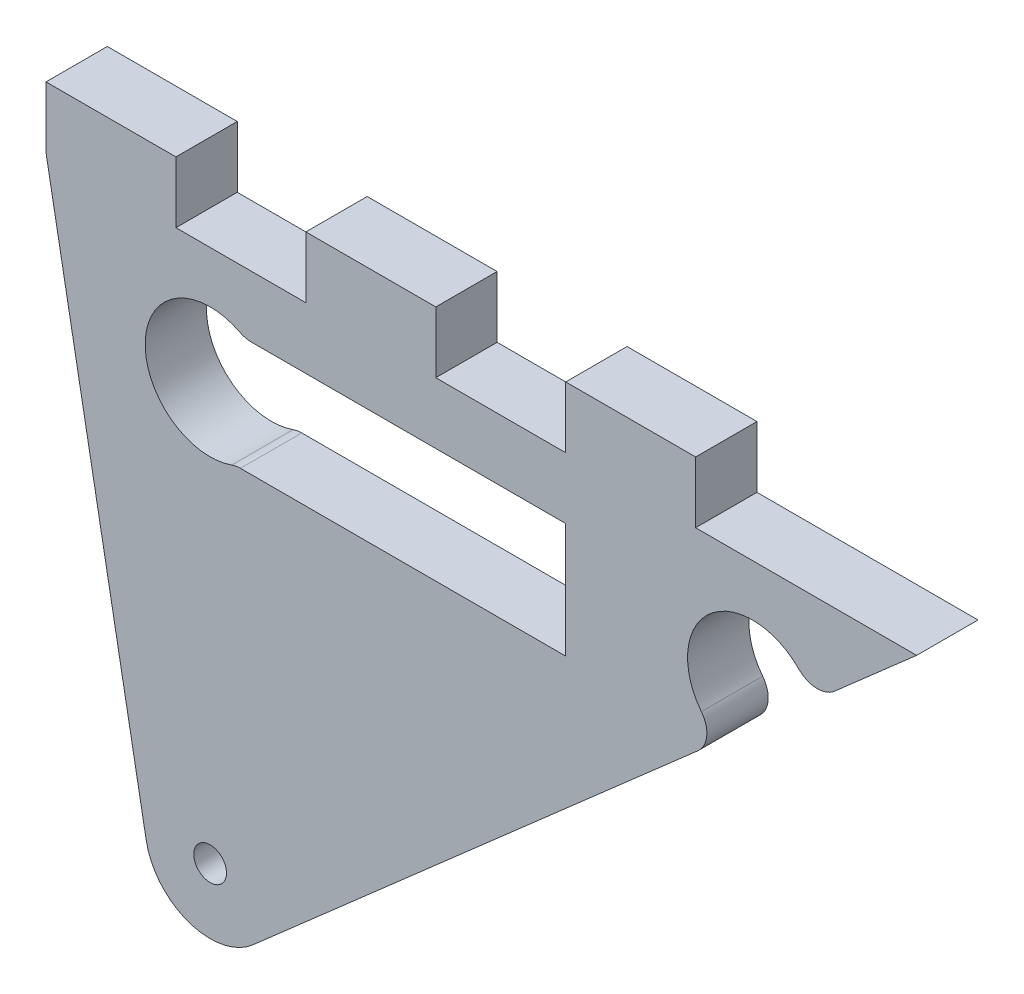
ISO-10303-21;
HEADER;
FILE_DESCRIPTION(('STEP AP214'),'2;1');
FILE_NAME('part.step','',(''),(''),'','','');
FILE_SCHEMA(('AUTOMOTIVE_DESIGN { 1 0 10303 214 1 1 1 1 }'));
ENDSEC;
DATA;
#1=APPLICATION_CONTEXT('core data for automotive mechanical design processes');
#2=APPLICATION_PROTOCOL_DEFINITION('international standard','automotive_design',2000,#1);
#3=PRODUCT_CONTEXT('',#1,'mechanical');
#4=PRODUCT('Part','Part','',(#3));
#5=PRODUCT_RELATED_PRODUCT_CATEGORY('part','',(#4));
#6=PRODUCT_DEFINITION_FORMATION('','',#4);
#7=PRODUCT_DEFINITION_CONTEXT('part definition',#1,'design');
#8=PRODUCT_DEFINITION('design','',#6,#7);
#9=PRODUCT_DEFINITION_SHAPE('','',#8);
#10=(LENGTH_UNIT() NAMED_UNIT(*) SI_UNIT(.MILLI.,.METRE.));
#11=(NAMED_UNIT(*) PLANE_ANGLE_UNIT() SI_UNIT($,.RADIAN.));
#12=(NAMED_UNIT(*) SI_UNIT($,.STERADIAN.) SOLID_ANGLE_UNIT());
#13=UNCERTAINTY_MEASURE_WITH_UNIT(LENGTH_MEASURE(1.E-05),#10,'distance_accuracy_value','');
#14=(GEOMETRIC_REPRESENTATION_CONTEXT(3) GLOBAL_UNCERTAINTY_ASSIGNED_CONTEXT((#13)) GLOBAL_UNIT_ASSIGNED_CONTEXT((#10,
#11,#12)) REPRESENTATION_CONTEXT('',''));
#15=CARTESIAN_POINT('',(0.,0.,0.));
#16=DIRECTION('',(0.,0.,1.));
#17=DIRECTION('',(1.,0.,0.));
#18=AXIS2_PLACEMENT_3D('',#15,#16,#17);
#19=CARTESIAN_POINT('',(1.19165429725396E-11,61.2277195457864,5.9944));
#20=DIRECTION('',(-1.94626601495886E-13,-1.,0.));
#21=DIRECTION('',(1.,-1.94626601495886E-13,0.));
#22=AXIS2_PLACEMENT_3D('',#19,#20,#21);
#23=PLANE('',#22);
#24=DIRECTION('',(-1.,1.94626601495886E-13,0.));
#25=VECTOR('',#24,1.);
#26=CARTESIAN_POINT('',(1.19165429725396E-11,61.2277195457864,0.));
#27=LINE('',#26,#25);
#28=CARTESIAN_POINT('',(367.753796066988,61.2277195457203,0.));
#29=VERTEX_POINT('',#28);
#30=CARTESIAN_POINT('',(335.959716919993,61.227719545721,0.));
#31=VERTEX_POINT('',#30);
#32=EDGE_CURVE('E489',#29,#31,#27,.T.);
#33=ORIENTED_EDGE('',*,*,#32,.T.);
#34=DIRECTION('',(0.,0.,-1.));
#35=VECTOR('',#34,1.);
#36=CARTESIAN_POINT('',(335.959716919993,61.227719545721,5.9944));
#37=LINE('',#36,#35);
#38=CARTESIAN_POINT('',(335.959716919993,61.227719545721,5.9944));
#39=VERTEX_POINT('',#38);
#40=EDGE_CURVE('E12',#39,#31,#37,.T.);
#41=ORIENTED_EDGE('',*,*,#40,.F.);
#42=DIRECTION('',(-1.,1.94626601495886E-13,0.));
#43=VECTOR('',#42,1.);
#44=CARTESIAN_POINT('',(1.19165429725396E-11,61.2277195457864,5.9944));
#45=LINE('',#44,#43);
#46=CARTESIAN_POINT('',(367.753796066988,61.2277195457203,5.9944));
#47=VERTEX_POINT('',#46);
#48=EDGE_CURVE('E258',#47,#39,#45,.T.);
#49=ORIENTED_EDGE('',*,*,#48,.F.);
#50=DIRECTION('',(0.,0.,-1.));
#51=VECTOR('',#50,1.);
#52=CARTESIAN_POINT('',(367.753796066988,61.2277195457203,5.9944));
#53=LINE('',#52,#51);
#54=EDGE_CURVE('E375',#47,#29,#53,.T.);
#55=ORIENTED_EDGE('',*,*,#54,.T.);
#56=EDGE_LOOP('',(#33,#41,#49,#55));
#57=FACE_BOUND('',#56,.T.);
#58=ADVANCED_FACE('F38',(#57),#23,.F.);
#59=CARTESIAN_POINT('',(335.959716919992,58.687719545721,5.9944));
#60=DIRECTION('',(0.,0.,-1.));
#61=DIRECTION('',(-1.,0.,0.));
#62=AXIS2_PLACEMENT_3D('',#59,#60,#61);
#63=CYLINDRICAL_SURFACE('',#62,2.53999999999999);
#64=CARTESIAN_POINT('',(335.959716919992,58.687719545721,0.));
#65=DIRECTION('',(0.,0.,1.));
#66=DIRECTION('',(1.,0.,0.));
#67=AXIS2_PLACEMENT_3D('',#64,#65,#66);
#68=CIRCLE('',#67,2.53999999999999);
#69=CARTESIAN_POINT('',(335.113137595869,61.0824853898,0.));
#70=VERTEX_POINT('',#69);
#71=EDGE_CURVE('E492',#31,#70,#68,.T.);
#72=ORIENTED_EDGE('',*,*,#71,.T.);
#73=DIRECTION('',(0.,0.,-1.));
#74=VECTOR('',#73,1.);
#75=CARTESIAN_POINT('',(335.113137595869,61.0824853898,5.9944));
#76=LINE('',#75,#74);
#77=CARTESIAN_POINT('',(335.113137595869,61.0824853898,5.9944));
#78=VERTEX_POINT('',#77);
#79=EDGE_CURVE('E48',#78,#70,#76,.T.);
#80=ORIENTED_EDGE('',*,*,#79,.F.);
#81=CARTESIAN_POINT('',(335.959716919992,58.687719545721,5.9944));
#82=DIRECTION('',(0.,0.,1.));
#83=DIRECTION('',(1.,0.,0.));
#84=AXIS2_PLACEMENT_3D('',#81,#82,#83);
#85=CIRCLE('',#84,2.53999999999999);
#86=EDGE_CURVE('E254',#39,#78,#85,.T.);
#87=ORIENTED_EDGE('',*,*,#86,.F.);
#88=ORIENTED_EDGE('',*,*,#40,.T.);
#89=EDGE_LOOP('',(#72,#80,#87,#88));
#90=FACE_BOUND('',#89,.T.);
#91=ADVANCED_FACE('F519',(#90),#63,.T.);
#92=CARTESIAN_POINT('',(332.996689285562,67.0693999999975,5.9944));
#93=DIRECTION('',(0.,0.,-1.));
#94=DIRECTION('',(-1.,0.,0.));
#95=AXIS2_PLACEMENT_3D('',#92,#93,#94);
#96=CYLINDRICAL_SURFACE('',#95,6.35);
#97=CARTESIAN_POINT('',(332.996689285562,67.0693999999975,0.));
#98=DIRECTION('',(0.,0.,1.));
#99=DIRECTION('',(1.,0.,0.));
#100=AXIS2_PLACEMENT_3D('',#97,#98,#99);
#101=CIRCLE('',#100,6.35);
#102=CARTESIAN_POINT('',(335.880156908163,72.7269714285707,0.));
#103=VERTEX_POINT('',#102);
#104=EDGE_CURVE('E495',#103,#70,#101,.T.);
#105=ORIENTED_EDGE('',*,*,#104,.F.);
#106=DIRECTION('',(0.,0.,-1.));
#107=VECTOR('',#106,1.);
#108=CARTESIAN_POINT('',(335.880156908163,72.7269714285707,5.9944));
#109=LINE('',#108,#107);
#110=CARTESIAN_POINT('',(335.880156908163,72.7269714285707,5.9944));
#111=VERTEX_POINT('',#110);
#112=EDGE_CURVE('E230',#111,#103,#109,.T.);
#113=ORIENTED_EDGE('',*,*,#112,.F.);
#114=CARTESIAN_POINT('',(332.996689285562,67.0693999999975,5.9944));
#115=DIRECTION('',(0.,0.,1.));
#116=DIRECTION('',(1.,0.,0.));
#117=AXIS2_PLACEMENT_3D('',#114,#115,#116);
#118=CIRCLE('',#117,6.35);
#119=EDGE_CURVE('E236',#111,#78,#118,.T.);
#120=ORIENTED_EDGE('',*,*,#119,.T.);
#121=ORIENTED_EDGE('',*,*,#79,.T.);
#122=EDGE_LOOP('',(#105,#113,#120,#121));
#123=FACE_BOUND('',#122,.T.);
#124=ADVANCED_FACE('F524',(#123),#96,.F.);
#125=CARTESIAN_POINT('',(337.033543957204,74.9899999999999,5.9944));
#126=DIRECTION('',(0.,0.,-1.));
#127=DIRECTION('',(-1.,0.,0.));
#128=AXIS2_PLACEMENT_3D('',#125,#126,#127);
#129=CYLINDRICAL_SURFACE('',#128,2.54);
#130=CARTESIAN_POINT('',(337.033543957204,74.9899999999999,0.));
#131=DIRECTION('',(0.,0.,1.));
#132=DIRECTION('',(1.,0.,0.));
#133=AXIS2_PLACEMENT_3D('',#130,#131,#132);
#134=CIRCLE('',#133,2.54);
#135=CARTESIAN_POINT('',(337.033543957204,72.4499999999999,0.));
#136=VERTEX_POINT('',#135);
#137=EDGE_CURVE('E225',#136,#103,#134,.F.);
#138=ORIENTED_EDGE('',*,*,#137,.F.);
#139=DIRECTION('',(0.,0.,-1.));
#140=VECTOR('',#139,1.);
#141=CARTESIAN_POINT('',(337.033543957204,72.4499999999999,5.9944));
#142=LINE('',#141,#140);
#143=CARTESIAN_POINT('',(337.033543957204,72.4499999999999,5.9944));
#144=VERTEX_POINT('',#143);
#145=EDGE_CURVE('E220',#144,#136,#142,.T.);
#146=ORIENTED_EDGE('',*,*,#145,.F.);
#147=CARTESIAN_POINT('',(337.033543957204,74.9899999999999,5.9944));
#148=DIRECTION('',(0.,0.,1.));
#149=DIRECTION('',(1.,0.,0.));
#150=AXIS2_PLACEMENT_3D('',#147,#148,#149);
#151=CIRCLE('',#150,2.54);
#152=EDGE_CURVE('E223',#144,#111,#151,.F.);
#153=ORIENTED_EDGE('',*,*,#152,.T.);
#154=ORIENTED_EDGE('',*,*,#112,.T.);
#155=EDGE_LOOP('',(#138,#146,#153,#154));
#156=FACE_BOUND('',#155,.T.);
#157=ADVANCED_FACE('F222',(#156),#129,.T.);
#158=CARTESIAN_POINT('',(0.,72.4499999999999,5.9944));
#159=DIRECTION('',(0.,-1.,0.));
#160=DIRECTION('',(0.,0.,-1.));
#161=AXIS2_PLACEMENT_3D('',#158,#159,#160);
#162=PLANE('',#161);
#163=DIRECTION('',(-1.,0.,0.));
#164=VECTOR('',#163,1.);
#165=CARTESIAN_POINT('',(0.,72.4499999999999,0.));
#166=LINE('',#165,#164);
#167=CARTESIAN_POINT('',(367.753796066988,72.4499999999999,0.));
#168=VERTEX_POINT('',#167);
#169=EDGE_CURVE('E370',#168,#136,#166,.T.);
#170=ORIENTED_EDGE('',*,*,#169,.F.);
#171=DIRECTION('',(0.,0.,-1.));
#172=VECTOR('',#171,1.);
#173=CARTESIAN_POINT('',(367.753796066988,72.4499999999999,5.9944));
#174=LINE('',#173,#172);
#175=CARTESIAN_POINT('',(367.753796066988,72.4499999999999,5.9944));
#176=VERTEX_POINT('',#175);
#177=EDGE_CURVE('E139',#176,#168,#174,.T.);
#178=ORIENTED_EDGE('',*,*,#177,.F.);
#179=DIRECTION('',(-1.,0.,0.));
#180=VECTOR('',#179,1.);
#181=CARTESIAN_POINT('',(0.,72.4499999999999,5.9944));
#182=LINE('',#181,#180);
#183=EDGE_CURVE('E234',#176,#144,#182,.T.);
#184=ORIENTED_EDGE('',*,*,#183,.T.);
#185=ORIENTED_EDGE('',*,*,#145,.T.);
#186=EDGE_LOOP('',(#170,#178,#184,#185));
#187=FACE_BOUND('',#186,.T.);
#188=ADVANCED_FACE('F239',(#187),#162,.T.);
#189=CARTESIAN_POINT('',(379.010840530731,61.5956615842181,5.9944));
#190=DIRECTION('',(0.,0.,-1.));
#191=DIRECTION('',(-1.,0.,0.));
#192=AXIS2_PLACEMENT_3D('',#189,#190,#191);
#193=CYLINDRICAL_SURFACE('',#192,2.54000000000001);
#194=CARTESIAN_POINT('',(379.010840530731,61.5956615842181,0.));
#195=DIRECTION('',(0.,0.,1.));
#196=DIRECTION('',(1.,0.,0.));
#197=AXIS2_PLACEMENT_3D('',#194,#195,#196);
#198=CIRCLE('',#197,2.54000000000001);
#199=CARTESIAN_POINT('',(381.012274460683,63.1595868458707,0.));
#200=VERTEX_POINT('',#199);
#201=CARTESIAN_POINT('',(380.686318008729,59.6866369063469,0.));
#202=VERTEX_POINT('',#201);
#203=EDGE_CURVE('E427',#200,#202,#198,.F.);
#204=ORIENTED_EDGE('',*,*,#203,.F.);
#205=DIRECTION('',(0.,0.,-1.));
#206=VECTOR('',#205,1.);
#207=CARTESIAN_POINT('',(381.012274460683,63.1595868458707,5.9944));
#208=LINE('',#207,#206);
#209=CARTESIAN_POINT('',(381.012274460683,63.1595868458707,5.9944));
#210=VERTEX_POINT('',#209);
#211=EDGE_CURVE('E42',#210,#200,#208,.T.);
#212=ORIENTED_EDGE('',*,*,#211,.F.);
#213=CARTESIAN_POINT('',(379.010840530731,61.5956615842181,5.9944));
#214=DIRECTION('',(0.,0.,1.));
#215=DIRECTION('',(1.,0.,0.));
#216=AXIS2_PLACEMENT_3D('',#213,#214,#215);
#217=CIRCLE('',#216,2.54000000000001);
#218=CARTESIAN_POINT('',(380.686318008729,59.6866369063469,5.9944));
#219=VERTEX_POINT('',#218);
#220=EDGE_CURVE('E367',#210,#219,#217,.F.);
#221=ORIENTED_EDGE('',*,*,#220,.T.);
#222=DIRECTION('',(0.,0.,-1.));
#223=VECTOR('',#222,1.);
#224=CARTESIAN_POINT('',(380.686318008729,59.6866369063469,5.9944));
#225=LINE('',#224,#223);
#226=EDGE_CURVE('E243',#219,#202,#225,.T.);
#227=ORIENTED_EDGE('',*,*,#226,.T.);
#228=EDGE_LOOP('',(#204,#212,#221,#227));
#229=FACE_BOUND('',#228,.T.);
#230=ADVANCED_FACE('F40',(#229),#193,.T.);
#231=CARTESIAN_POINT('',(386.015859285561,67.0694000000001,5.9944));
#232=DIRECTION('',(0.,0.,-1.));
#233=DIRECTION('',(-1.,0.,0.));
#234=AXIS2_PLACEMENT_3D('',#231,#232,#233);
#235=CYLINDRICAL_SURFACE('',#234,6.3499999999965);
#236=CARTESIAN_POINT('',(386.015859285561,67.0694000000001,0.));
#237=DIRECTION('',(0.,0.,1.));
#238=DIRECTION('',(1.,0.,0.));
#239=AXIS2_PLACEMENT_3D('',#236,#237,#238);
#240=CIRCLE('',#239,6.3499999999965);
#241=CARTESIAN_POINT('',(390.541875435002,71.5233508096694,0.));
#242=VERTEX_POINT('',#241);
#243=EDGE_CURVE('E424',#242,#200,#240,.T.);
#244=ORIENTED_EDGE('',*,*,#243,.F.);
#245=DIRECTION('',(0.,0.,-1.));
#246=VECTOR('',#245,1.);
#247=CARTESIAN_POINT('',(390.541875435002,71.5233508096694,5.9944));
#248=LINE('',#247,#246);
#249=CARTESIAN_POINT('',(390.541875435002,71.5233508096694,5.9944));
#250=VERTEX_POINT('',#249);
#251=EDGE_CURVE('E415',#250,#242,#248,.T.);
#252=ORIENTED_EDGE('',*,*,#251,.F.);
#253=CARTESIAN_POINT('',(386.015859285561,67.0694000000001,5.9944));
#254=DIRECTION('',(0.,0.,1.));
#255=DIRECTION('',(1.,0.,0.));
#256=AXIS2_PLACEMENT_3D('',#253,#254,#255);
#257=CIRCLE('',#256,6.3499999999965);
#258=EDGE_CURVE('E362',#250,#210,#257,.T.);
#259=ORIENTED_EDGE('',*,*,#258,.T.);
#260=ORIENTED_EDGE('',*,*,#211,.T.);
#261=EDGE_LOOP('',(#244,#252,#259,#260));
#262=FACE_BOUND('',#261,.T.);
#263=ADVANCED_FACE('F422',(#262),#235,.F.);
#264=CARTESIAN_POINT('',(392.35228189478,73.3049311335381,5.9944));
#265=DIRECTION('',(0.,0.,-1.));
#266=DIRECTION('',(-1.,0.,0.));
#267=AXIS2_PLACEMENT_3D('',#264,#265,#266);
#268=CYLINDRICAL_SURFACE('',#267,2.54000000000001);
#269=CARTESIAN_POINT('',(392.35228189478,73.3049311335381,0.));
#270=DIRECTION('',(0.,0.,1.));
#271=DIRECTION('',(1.,0.,0.));
#272=AXIS2_PLACEMENT_3D('',#269,#270,#271);
#273=CIRCLE('',#272,2.54000000000001);
#274=CARTESIAN_POINT('',(394.027759372778,71.395906455667,0.));
#275=VERTEX_POINT('',#274);
#276=EDGE_CURVE('E434',#242,#275,#273,.T.);
#277=ORIENTED_EDGE('',*,*,#276,.T.);
#278=DIRECTION('',(0.,0.,-1.));
#279=VECTOR('',#278,1.);
#280=CARTESIAN_POINT('',(394.027759372778,71.395906455667,5.9944));
#281=LINE('',#280,#279);
#282=CARTESIAN_POINT('',(394.027759372778,71.395906455667,5.9944));
#283=VERTEX_POINT('',#282);
#284=EDGE_CURVE('E414',#283,#275,#281,.T.);
#285=ORIENTED_EDGE('',*,*,#284,.F.);
#286=CARTESIAN_POINT('',(392.35228189478,73.3049311335381,5.9944));
#287=DIRECTION('',(0.,0.,1.));
#288=DIRECTION('',(1.,0.,0.));
#289=AXIS2_PLACEMENT_3D('',#286,#287,#288);
#290=CIRCLE('',#289,2.54000000000001);
#291=EDGE_CURVE('E358',#250,#283,#290,.T.);
#292=ORIENTED_EDGE('',*,*,#291,.F.);
#293=ORIENTED_EDGE('',*,*,#251,.T.);
#294=EDGE_LOOP('',(#277,#285,#292,#293));
#295=FACE_BOUND('',#294,.T.);
#296=ADVANCED_FACE('F595',(#295),#268,.T.);
#297=CARTESIAN_POINT('',(136.053489749317,-155.018180102464,5.9944));
#298=DIRECTION('',(0.659636802361466,-0.751584518846909,0.));
#299=DIRECTION('',(0.751584518846909,0.659636802361466,0.));
#300=AXIS2_PLACEMENT_3D('',#297,#298,#299);
#301=PLANE('',#300);
#302=DIRECTION('',(-0.751584518846909,-0.659636802361466,0.));
#303=VECTOR('',#302,1.);
#304=CARTESIAN_POINT('',(136.053489749317,-155.018180102464,0.));
#305=LINE('',#304,#303);
#306=CARTESIAN_POINT('',(402.058752504374,78.4443999999999,0.));
#307=VERTEX_POINT('',#306);
#308=EDGE_CURVE('E436',#307,#275,#305,.T.);
#309=ORIENTED_EDGE('',*,*,#308,.F.);
#310=DIRECTION('',(0.,0.,-1.));
#311=VECTOR('',#310,1.);
#312=CARTESIAN_POINT('',(402.058752504374,78.4443999999999,5.9944));
#313=LINE('',#312,#311);
#314=CARTESIAN_POINT('',(402.058752504374,78.4443999999999,5.9944));
#315=VERTEX_POINT('',#314);
#316=EDGE_CURVE('E412',#315,#307,#313,.T.);
#317=ORIENTED_EDGE('',*,*,#316,.F.);
#318=DIRECTION('',(-0.751584518846909,-0.659636802361466,0.));
#319=VECTOR('',#318,1.);
#320=CARTESIAN_POINT('',(136.053489749317,-155.018180102464,5.9944));
#321=LINE('',#320,#319);
#322=EDGE_CURVE('E354',#315,#283,#321,.T.);
#323=ORIENTED_EDGE('',*,*,#322,.T.);
#324=ORIENTED_EDGE('',*,*,#284,.T.);
#325=EDGE_LOOP('',(#309,#317,#323,#324));
#326=FACE_BOUND('',#325,.T.);
#327=ADVANCED_FACE('F591',(#326),#301,.T.);
#328=CARTESIAN_POINT('',(0.,78.4443999999999,5.9944));
#329=DIRECTION('',(0.,1.,0.));
#330=DIRECTION('',(0.,0.,1.));
#331=AXIS2_PLACEMENT_3D('',#328,#329,#330);
#332=PLANE('',#331);
#333=DIRECTION('',(1.,0.,0.));
#334=VECTOR('',#333,1.);
#335=CARTESIAN_POINT('',(0.,78.4443999999999,0.));
#336=LINE('',#335,#334);
#337=CARTESIAN_POINT('',(380.453796066988,78.4443999999999,0.));
#338=VERTEX_POINT('',#337);
#339=EDGE_CURVE('E440',#338,#307,#336,.T.);
#340=ORIENTED_EDGE('',*,*,#339,.F.);
#341=DIRECTION('',(0.,0.,-1.));
#342=VECTOR('',#341,1.);
#343=CARTESIAN_POINT('',(380.453796066988,78.4443999999999,5.9944));
#344=LINE('',#343,#342);
#345=CARTESIAN_POINT('',(380.453796066988,78.4443999999999,5.9944));
#346=VERTEX_POINT('',#345);
#347=EDGE_CURVE('E410',#346,#338,#344,.T.);
#348=ORIENTED_EDGE('',*,*,#347,.F.);
#349=DIRECTION('',(1.,0.,0.));
#350=VECTOR('',#349,1.);
#351=CARTESIAN_POINT('',(0.,78.4443999999999,5.9944));
#352=LINE('',#351,#350);
#353=EDGE_CURVE('E346',#346,#315,#352,.T.);
#354=ORIENTED_EDGE('',*,*,#353,.T.);
#355=ORIENTED_EDGE('',*,*,#316,.T.);
#356=EDGE_LOOP('',(#340,#348,#354,#355));
#357=FACE_BOUND('',#356,.T.);
#358=ADVANCED_FACE('F587',(#357),#332,.T.);
#359=CARTESIAN_POINT('',(380.453796066988,0.,5.9944));
#360=DIRECTION('',(1.,0.,0.));
#361=DIRECTION('',(0.,0.,-1.));
#362=AXIS2_PLACEMENT_3D('',#359,#360,#361);
#363=PLANE('',#362);
#364=DIRECTION('',(0.,-1.,0.));
#365=VECTOR('',#364,1.);
#366=CARTESIAN_POINT('',(380.453796066988,0.,0.));
#367=LINE('',#366,#365);
#368=CARTESIAN_POINT('',(380.453796066988,84.4387999999999,0.));
#369=VERTEX_POINT('',#368);
#370=EDGE_CURVE('E443',#369,#338,#367,.T.);
#371=ORIENTED_EDGE('',*,*,#370,.F.);
#372=DIRECTION('',(0.,0.,-1.));
#373=VECTOR('',#372,1.);
#374=CARTESIAN_POINT('',(380.453796066988,84.4387999999999,5.9944));
#375=LINE('',#374,#373);
#376=CARTESIAN_POINT('',(380.453796066988,84.4387999999999,5.9944));
#377=VERTEX_POINT('',#376);
#378=EDGE_CURVE('E408',#377,#369,#375,.T.);
#379=ORIENTED_EDGE('',*,*,#378,.F.);
#380=DIRECTION('',(0.,-1.,0.));
#381=VECTOR('',#380,1.);
#382=CARTESIAN_POINT('',(380.453796066988,0.,5.9944));
#383=LINE('',#382,#381);
#384=EDGE_CURVE('E341',#377,#346,#383,.T.);
#385=ORIENTED_EDGE('',*,*,#384,.T.);
#386=ORIENTED_EDGE('',*,*,#347,.T.);
#387=EDGE_LOOP('',(#371,#379,#385,#386));
#388=FACE_BOUND('',#387,.T.);
#389=ADVANCED_FACE('F583',(#388),#363,.T.);
#390=CARTESIAN_POINT('',(7.56610609685106E-12,84.438800000034,5.9944));
#391=DIRECTION('',(0.,1.,0.));
#392=DIRECTION('',(-1.,0.,0.));
#393=AXIS2_PLACEMENT_3D('',#390,#391,#392);
#394=PLANE('',#393);
#395=DIRECTION('',(1.,0.,0.));
#396=VECTOR('',#395,1.);
#397=CARTESIAN_POINT('',(7.56610609685106E-12,84.438800000034,0.));
#398=LINE('',#397,#396);
#399=CARTESIAN_POINT('',(367.753796066983,84.4388000000011,0.));
#400=VERTEX_POINT('',#399);
#401=EDGE_CURVE('E446',#400,#369,#398,.T.);
#402=ORIENTED_EDGE('',*,*,#401,.F.);
#403=DIRECTION('',(0.,0.,-1.));
#404=VECTOR('',#403,1.);
#405=CARTESIAN_POINT('',(367.753796066983,84.4388000000011,5.9944));
#406=LINE('',#405,#404);
#407=CARTESIAN_POINT('',(367.753796066983,84.4388000000011,5.9944));
#408=VERTEX_POINT('',#407);
#409=EDGE_CURVE('E406',#408,#400,#406,.T.);
#410=ORIENTED_EDGE('',*,*,#409,.F.);
#411=DIRECTION('',(1.,0.,0.));
#412=VECTOR('',#411,1.);
#413=CARTESIAN_POINT('',(7.56610609685106E-12,84.438800000034,5.9944));
#414=LINE('',#413,#412);
#415=EDGE_CURVE('E336',#408,#377,#414,.T.);
#416=ORIENTED_EDGE('',*,*,#415,.T.);
#417=ORIENTED_EDGE('',*,*,#378,.T.);
#418=EDGE_LOOP('',(#402,#410,#416,#417));
#419=FACE_BOUND('',#418,.T.);
#420=ADVANCED_FACE('F579',(#419),#394,.T.);
#421=CARTESIAN_POINT('',(367.753796066983,0.,5.9944));
#422=DIRECTION('',(-1.,0.,0.));
#423=DIRECTION('',(0.,0.,1.));
#424=AXIS2_PLACEMENT_3D('',#421,#422,#423);
#425=PLANE('',#424);
#426=DIRECTION('',(0.,1.,0.));
#427=VECTOR('',#426,1.);
#428=CARTESIAN_POINT('',(367.753796066983,0.,0.));
#429=LINE('',#428,#427);
#430=CARTESIAN_POINT('',(367.753796066983,78.4444000000011,0.));
#431=VERTEX_POINT('',#430);
#432=EDGE_CURVE('E449',#431,#400,#429,.T.);
#433=ORIENTED_EDGE('',*,*,#432,.F.);
#434=DIRECTION('',(0.,0.,-1.));
#435=VECTOR('',#434,1.);
#436=CARTESIAN_POINT('',(367.753796066983,78.4444000000011,5.9944));
#437=LINE('',#436,#435);
#438=CARTESIAN_POINT('',(367.753796066983,78.4444000000011,5.9944));
#439=VERTEX_POINT('',#438);
#440=EDGE_CURVE('E404',#439,#431,#437,.T.);
#441=ORIENTED_EDGE('',*,*,#440,.F.);
#442=DIRECTION('',(0.,1.,0.));
#443=VECTOR('',#442,1.);
#444=CARTESIAN_POINT('',(367.753796066983,0.,5.9944));
#445=LINE('',#444,#443);
#446=EDGE_CURVE('E332',#439,#408,#445,.T.);
#447=ORIENTED_EDGE('',*,*,#446,.T.);
#448=ORIENTED_EDGE('',*,*,#409,.T.);
#449=EDGE_LOOP('',(#433,#441,#447,#448));
#450=FACE_BOUND('',#449,.T.);
#451=ADVANCED_FACE('F575',(#450),#425,.T.);
#452=CARTESIAN_POINT('',(0.,78.4444000000007,5.9944));
#453=DIRECTION('',(0.,1.,0.));
#454=DIRECTION('',(-1.,0.,0.));
#455=AXIS2_PLACEMENT_3D('',#452,#453,#454);
#456=PLANE('',#455);
#457=DIRECTION('',(1.,0.,0.));
#458=VECTOR('',#457,1.);
#459=CARTESIAN_POINT('',(0.,78.4444000000007,0.));
#460=LINE('',#459,#458);
#461=CARTESIAN_POINT('',(355.053796066983,78.4444000000011,0.));
#462=VERTEX_POINT('',#461);
#463=EDGE_CURVE('E452',#462,#431,#460,.T.);
#464=ORIENTED_EDGE('',*,*,#463,.F.);
#465=DIRECTION('',(0.,0.,-1.));
#466=VECTOR('',#465,1.);
#467=CARTESIAN_POINT('',(355.053796066983,78.4444000000011,5.9944));
#468=LINE('',#467,#466);
#469=CARTESIAN_POINT('',(355.053796066983,78.4444000000011,5.9944));
#470=VERTEX_POINT('',#469);
#471=EDGE_CURVE('E402',#470,#462,#468,.T.);
#472=ORIENTED_EDGE('',*,*,#471,.F.);
#473=DIRECTION('',(1.,0.,0.));
#474=VECTOR('',#473,1.);
#475=CARTESIAN_POINT('',(0.,78.4444000000007,5.9944));
#476=LINE('',#475,#474);
#477=EDGE_CURVE('E324',#470,#439,#476,.T.);
#478=ORIENTED_EDGE('',*,*,#477,.T.);
#479=ORIENTED_EDGE('',*,*,#440,.T.);
#480=EDGE_LOOP('',(#464,#472,#478,#479));
#481=FACE_BOUND('',#480,.T.);
#482=ADVANCED_FACE('F571',(#481),#456,.T.);
#483=CARTESIAN_POINT('',(355.053796066983,0.,5.9944));
#484=DIRECTION('',(1.,0.,0.));
#485=DIRECTION('',(0.,0.,-1.));
#486=AXIS2_PLACEMENT_3D('',#483,#484,#485);
#487=PLANE('',#486);
#488=DIRECTION('',(0.,-1.,0.));
#489=VECTOR('',#488,1.);
#490=CARTESIAN_POINT('',(355.053796066983,0.,0.));
#491=LINE('',#490,#489);
#492=CARTESIAN_POINT('',(355.053796066983,84.4388000000011,0.));
#493=VERTEX_POINT('',#492);
#494=EDGE_CURVE('E455',#493,#462,#491,.T.);
#495=ORIENTED_EDGE('',*,*,#494,.F.);
#496=DIRECTION('',(0.,0.,-1.));
#497=VECTOR('',#496,1.);
#498=CARTESIAN_POINT('',(355.053796066983,84.4388000000011,5.9944));
#499=LINE('',#498,#497);
#500=CARTESIAN_POINT('',(355.053796066983,84.4388000000011,5.9944));
#501=VERTEX_POINT('',#500);
#502=EDGE_CURVE('E400',#501,#493,#499,.T.);
#503=ORIENTED_EDGE('',*,*,#502,.F.);
#504=DIRECTION('',(0.,-1.,0.));
#505=VECTOR('',#504,1.);
#506=CARTESIAN_POINT('',(355.053796066983,0.,5.9944));
#507=LINE('',#506,#505);
#508=EDGE_CURVE('E319',#501,#470,#507,.T.);
#509=ORIENTED_EDGE('',*,*,#508,.T.);
#510=ORIENTED_EDGE('',*,*,#471,.T.);
#511=EDGE_LOOP('',(#495,#503,#509,#510));
#512=FACE_BOUND('',#511,.T.);
#513=ADVANCED_FACE('F567',(#512),#487,.T.);
#514=CARTESIAN_POINT('',(0.,84.4388000000011,5.9944));
#515=DIRECTION('',(0.,1.,0.));
#516=DIRECTION('',(0.,0.,1.));
#517=AXIS2_PLACEMENT_3D('',#514,#515,#516);
#518=PLANE('',#517);
#519=DIRECTION('',(1.,0.,0.));
#520=VECTOR('',#519,1.);
#521=CARTESIAN_POINT('',(0.,84.4388000000011,0.));
#522=LINE('',#521,#520);
#523=CARTESIAN_POINT('',(342.353796066983,84.4388000000011,0.));
#524=VERTEX_POINT('',#523);
#525=EDGE_CURVE('E458',#524,#493,#522,.T.);
#526=ORIENTED_EDGE('',*,*,#525,.F.);
#527=DIRECTION('',(0.,0.,-1.));
#528=VECTOR('',#527,1.);
#529=CARTESIAN_POINT('',(342.353796066983,84.4388000000011,5.9944));
#530=LINE('',#529,#528);
#531=CARTESIAN_POINT('',(342.353796066983,84.4388000000011,5.9944));
#532=VERTEX_POINT('',#531);
#533=EDGE_CURVE('E398',#532,#524,#530,.T.);
#534=ORIENTED_EDGE('',*,*,#533,.F.);
#535=DIRECTION('',(1.,0.,0.));
#536=VECTOR('',#535,1.);
#537=CARTESIAN_POINT('',(0.,84.4388000000011,5.9944));
#538=LINE('',#537,#536);
#539=EDGE_CURVE('E314',#532,#501,#538,.T.);
#540=ORIENTED_EDGE('',*,*,#539,.T.);
#541=ORIENTED_EDGE('',*,*,#502,.T.);
#542=EDGE_LOOP('',(#526,#534,#540,#541));
#543=FACE_BOUND('',#542,.T.);
#544=ADVANCED_FACE('F563',(#543),#518,.T.);
#545=CARTESIAN_POINT('',(342.353796066983,0.,5.9944));
#546=DIRECTION('',(-1.,0.,0.));
#547=DIRECTION('',(0.,0.,1.));
#548=AXIS2_PLACEMENT_3D('',#545,#546,#547);
#549=PLANE('',#548);
#550=DIRECTION('',(0.,1.,0.));
#551=VECTOR('',#550,1.);
#552=CARTESIAN_POINT('',(342.353796066983,0.,0.));
#553=LINE('',#552,#551);
#554=CARTESIAN_POINT('',(342.353796066983,78.4444000000002,0.));
#555=VERTEX_POINT('',#554);
#556=EDGE_CURVE('E461',#555,#524,#553,.T.);
#557=ORIENTED_EDGE('',*,*,#556,.F.);
#558=DIRECTION('',(0.,0.,-1.));
#559=VECTOR('',#558,1.);
#560=CARTESIAN_POINT('',(342.353796066983,78.4444000000002,5.9944));
#561=LINE('',#560,#559);
#562=CARTESIAN_POINT('',(342.353796066983,78.4444000000002,5.9944));
#563=VERTEX_POINT('',#562);
#564=EDGE_CURVE('E396',#563,#555,#561,.T.);
#565=ORIENTED_EDGE('',*,*,#564,.F.);
#566=DIRECTION('',(0.,1.,0.));
#567=VECTOR('',#566,1.);
#568=CARTESIAN_POINT('',(342.353796066983,0.,5.9944));
#569=LINE('',#568,#567);
#570=EDGE_CURVE('E310',#563,#532,#569,.T.);
#571=ORIENTED_EDGE('',*,*,#570,.T.);
#572=ORIENTED_EDGE('',*,*,#533,.T.);
#573=EDGE_LOOP('',(#557,#565,#571,#572));
#574=FACE_BOUND('',#573,.T.);
#575=ADVANCED_FACE('F559',(#574),#549,.T.);
#576=CARTESIAN_POINT('',(0.,78.4443999999998,5.9944));
#577=DIRECTION('',(0.,1.,0.));
#578=DIRECTION('',(-1.,0.,0.));
#579=AXIS2_PLACEMENT_3D('',#576,#577,#578);
#580=PLANE('',#579);
#581=DIRECTION('',(1.,0.,0.));
#582=VECTOR('',#581,1.);
#583=CARTESIAN_POINT('',(0.,78.4443999999998,0.));
#584=LINE('',#583,#582);
#585=CARTESIAN_POINT('',(329.653796066983,78.4444000000002,0.));
#586=VERTEX_POINT('',#585);
#587=EDGE_CURVE('E464',#586,#555,#584,.T.);
#588=ORIENTED_EDGE('',*,*,#587,.F.);
#589=DIRECTION('',(0.,0.,-1.));
#590=VECTOR('',#589,1.);
#591=CARTESIAN_POINT('',(329.653796066983,78.4444000000002,5.9944));
#592=LINE('',#591,#590);
#593=CARTESIAN_POINT('',(329.653796066983,78.4444000000002,5.9944));
#594=VERTEX_POINT('',#593);
#595=EDGE_CURVE('E394',#594,#586,#592,.T.);
#596=ORIENTED_EDGE('',*,*,#595,.F.);
#597=DIRECTION('',(1.,0.,0.));
#598=VECTOR('',#597,1.);
#599=CARTESIAN_POINT('',(0.,78.4443999999998,5.9944));
#600=LINE('',#599,#598);
#601=EDGE_CURVE('E302',#594,#563,#600,.T.);
#602=ORIENTED_EDGE('',*,*,#601,.T.);
#603=ORIENTED_EDGE('',*,*,#564,.T.);
#604=EDGE_LOOP('',(#588,#596,#602,#603));
#605=FACE_BOUND('',#604,.T.);
#606=ADVANCED_FACE('F555',(#605),#580,.T.);
#607=CARTESIAN_POINT('',(329.653796066983,0.,5.9944));
#608=DIRECTION('',(1.,0.,0.));
#609=DIRECTION('',(0.,0.,-1.));
#610=AXIS2_PLACEMENT_3D('',#607,#608,#609);
#611=PLANE('',#610);
#612=DIRECTION('',(0.,-1.,0.));
#613=VECTOR('',#612,1.);
#614=CARTESIAN_POINT('',(329.653796066983,0.,0.));
#615=LINE('',#614,#613);
#616=CARTESIAN_POINT('',(329.653796066983,84.4387999999999,0.));
#617=VERTEX_POINT('',#616);
#618=EDGE_CURVE('E467',#617,#586,#615,.T.);
#619=ORIENTED_EDGE('',*,*,#618,.F.);
#620=DIRECTION('',(0.,0.,-1.));
#621=VECTOR('',#620,1.);
#622=CARTESIAN_POINT('',(329.653796066983,84.4387999999999,5.9944));
#623=LINE('',#622,#621);
#624=CARTESIAN_POINT('',(329.653796066983,84.4387999999999,5.9944));
#625=VERTEX_POINT('',#624);
#626=EDGE_CURVE('E392',#625,#617,#623,.T.);
#627=ORIENTED_EDGE('',*,*,#626,.F.);
#628=DIRECTION('',(0.,-1.,0.));
#629=VECTOR('',#628,1.);
#630=CARTESIAN_POINT('',(329.653796066983,0.,5.9944));
#631=LINE('',#630,#629);
#632=EDGE_CURVE('E297',#625,#594,#631,.T.);
#633=ORIENTED_EDGE('',*,*,#632,.T.);
#634=ORIENTED_EDGE('',*,*,#595,.T.);
#635=EDGE_LOOP('',(#619,#627,#633,#634));
#636=FACE_BOUND('',#635,.T.);
#637=ADVANCED_FACE('F551',(#636),#611,.T.);
#638=CARTESIAN_POINT('',(0.,84.4387999999999,5.9944));
#639=DIRECTION('',(0.,1.,0.));
#640=DIRECTION('',(0.,0.,1.));
#641=AXIS2_PLACEMENT_3D('',#638,#639,#640);
#642=PLANE('',#641);
#643=DIRECTION('',(1.,0.,0.));
#644=VECTOR('',#643,1.);
#645=CARTESIAN_POINT('',(0.,84.4387999999999,0.));
#646=LINE('',#645,#644);
#647=CARTESIAN_POINT('',(316.953796066988,84.4387999999999,0.));
#648=VERTEX_POINT('',#647);
#649=EDGE_CURVE('E470',#648,#617,#646,.T.);
#650=ORIENTED_EDGE('',*,*,#649,.F.);
#651=DIRECTION('',(0.,0.,-1.));
#652=VECTOR('',#651,1.);
#653=CARTESIAN_POINT('',(316.953796066988,84.4387999999999,5.9944));
#654=LINE('',#653,#652);
#655=CARTESIAN_POINT('',(316.953796066988,84.4387999999999,5.9944));
#656=VERTEX_POINT('',#655);
#657=EDGE_CURVE('E390',#656,#648,#654,.T.);
#658=ORIENTED_EDGE('',*,*,#657,.F.);
#659=DIRECTION('',(1.,0.,0.));
#660=VECTOR('',#659,1.);
#661=CARTESIAN_POINT('',(0.,84.4387999999999,5.9944));
#662=LINE('',#661,#660);
#663=EDGE_CURVE('E292',#656,#625,#662,.T.);
#664=ORIENTED_EDGE('',*,*,#663,.T.);
#665=ORIENTED_EDGE('',*,*,#626,.T.);
#666=EDGE_LOOP('',(#650,#658,#664,#665));
#667=FACE_BOUND('',#666,.T.);
#668=ADVANCED_FACE('F547',(#667),#642,.T.);
#669=CARTESIAN_POINT('',(316.953796066972,-6.1060431885863E-11,5.9944));
#670=DIRECTION('',(-1.,1.92647738072716E-13,0.));
#671=DIRECTION('',(-1.92647738072716E-13,-1.,0.));
#672=AXIS2_PLACEMENT_3D('',#669,#670,#671);
#673=PLANE('',#672);
#674=DIRECTION('',(1.92647738072716E-13,1.,0.));
#675=VECTOR('',#674,1.);
#676=CARTESIAN_POINT('',(316.953796066972,-6.1060431885863E-11,0.));
#677=LINE('',#676,#675);
#678=CARTESIAN_POINT('',(316.953796066987,78.6758305733561,0.));
#679=VERTEX_POINT('',#678);
#680=EDGE_CURVE('E473',#679,#648,#677,.T.);
#681=ORIENTED_EDGE('',*,*,#680,.F.);
#682=DIRECTION('',(0.,0.,-1.));
#683=VECTOR('',#682,1.);
#684=CARTESIAN_POINT('',(316.953796066987,78.6758305733561,5.9944));
#685=LINE('',#684,#683);
#686=CARTESIAN_POINT('',(316.953796066987,78.6758305733561,5.9944));
#687=VERTEX_POINT('',#686);
#688=EDGE_CURVE('E388',#687,#679,#685,.T.);
#689=ORIENTED_EDGE('',*,*,#688,.F.);
#690=DIRECTION('',(1.92647738072716E-13,1.,0.));
#691=VECTOR('',#690,1.);
#692=CARTESIAN_POINT('',(316.953796066972,-6.1060431885863E-11,5.9944));
#693=LINE('',#692,#691);
#694=EDGE_CURVE('E288',#687,#656,#693,.T.);
#695=ORIENTED_EDGE('',*,*,#694,.T.);
#696=ORIENTED_EDGE('',*,*,#657,.T.);
#697=EDGE_LOOP('',(#681,#689,#695,#696));
#698=FACE_BOUND('',#697,.T.);
#699=ADVANCED_FACE('F543',(#698),#673,.T.);
#700=CARTESIAN_POINT('',(319.493796066987,78.6758305733561,5.9944));
#701=DIRECTION('',(0.,0.,-1.));
#702=DIRECTION('',(-1.,0.,0.));
#703=AXIS2_PLACEMENT_3D('',#700,#701,#702);
#704=CYLINDRICAL_SURFACE('',#703,2.53999999999999);
#705=CARTESIAN_POINT('',(319.493796066987,78.6758305733561,0.));
#706=DIRECTION('',(0.,0.,1.));
#707=DIRECTION('',(1.,0.,0.));
#708=AXIS2_PLACEMENT_3D('',#705,#706,#707);
#709=CIRCLE('',#708,2.53999999999999);
#710=CARTESIAN_POINT('',(316.995622149459,78.2167803824413,0.));
#711=VERTEX_POINT('',#710);
#712=EDGE_CURVE('E476',#711,#679,#709,.F.);
#713=ORIENTED_EDGE('',*,*,#712,.F.);
#714=DIRECTION('',(0.,0.,-1.));
#715=VECTOR('',#714,1.);
#716=CARTESIAN_POINT('',(316.995622149459,78.2167803824413,5.9944));
#717=LINE('',#716,#715);
#718=CARTESIAN_POINT('',(316.995622149459,78.2167803824413,5.9944));
#719=VERTEX_POINT('',#718);
#720=EDGE_CURVE('E386',#719,#711,#717,.T.);
#721=ORIENTED_EDGE('',*,*,#720,.F.);
#722=CARTESIAN_POINT('',(319.493796066987,78.6758305733561,5.9944));
#723=DIRECTION('',(0.,0.,1.));
#724=DIRECTION('',(1.,0.,0.));
#725=AXIS2_PLACEMENT_3D('',#722,#723,#724);
#726=CIRCLE('',#725,2.53999999999999);
#727=EDGE_CURVE('E282',#719,#687,#726,.F.);
#728=ORIENTED_EDGE('',*,*,#727,.T.);
#729=ORIENTED_EDGE('',*,*,#688,.T.);
#730=EDGE_LOOP('',(#713,#721,#728,#729));
#731=FACE_BOUND('',#730,.T.);
#732=ADVANCED_FACE('F539',(#731),#704,.T.);
#733=CARTESIAN_POINT('',(320.5448878388,58.901500382618,5.9944));
#734=DIRECTION('',(0.983533038397156,0.180728421620004,0.));
#735=DIRECTION('',(-0.180728421620004,0.983533038397156,0.));
#736=AXIS2_PLACEMENT_3D('',#733,#734,#735);
#737=PLANE('',#736);
#738=DIRECTION('',(0.180728421620004,-0.983533038397156,0.));
#739=VECTOR('',#738,1.);
#740=CARTESIAN_POINT('',(320.5448878388,58.901500382618,0.));
#741=LINE('',#740,#739);
#742=CARTESIAN_POINT('',(326.749772708152,25.1342090304595,0.));
#743=VERTEX_POINT('',#742);
#744=EDGE_CURVE('E479',#711,#743,#741,.T.);
#745=ORIENTED_EDGE('',*,*,#744,.T.);
#746=DIRECTION('',(0.,0.,-1.));
#747=VECTOR('',#746,1.);
#748=CARTESIAN_POINT('',(326.749772708152,25.1342090304595,5.9944));
#749=LINE('',#748,#747);
#750=CARTESIAN_POINT('',(326.749772708152,25.1342090304595,5.9944));
#751=VERTEX_POINT('',#750);
#752=EDGE_CURVE('E383',#751,#743,#749,.T.);
#753=ORIENTED_EDGE('',*,*,#752,.F.);
#754=DIRECTION('',(0.180728421620004,-0.983533038397156,0.));
#755=VECTOR('',#754,1.);
#756=CARTESIAN_POINT('',(320.5448878388,58.901500382618,5.9944));
#757=LINE('',#756,#755);
#758=EDGE_CURVE('E278',#719,#751,#757,.T.);
#759=ORIENTED_EDGE('',*,*,#758,.F.);
#760=ORIENTED_EDGE('',*,*,#720,.T.);
#761=EDGE_LOOP('',(#745,#753,#759,#760));
#762=FACE_BOUND('',#761,.T.);
#763=ADVANCED_FACE('F535',(#762),#737,.F.);
#764=CARTESIAN_POINT('',(332.996689227543,26.2821067811862,5.9944));
#765=DIRECTION('',(0.,0.,-1.));
#766=DIRECTION('',(-1.,0.,0.));
#767=AXIS2_PLACEMENT_3D('',#764,#765,#766);
#768=CYLINDRICAL_SURFACE('',#767,6.35150653360052);
#769=CARTESIAN_POINT('',(332.996689227543,26.2821067811862,0.));
#770=DIRECTION('',(0.,0.,1.));
#771=DIRECTION('',(1.,0.,0.));
#772=AXIS2_PLACEMENT_3D('',#769,#770,#771);
#773=CIRCLE('',#772,6.35150653360052);
#774=CARTESIAN_POINT('',(337.186376687546,21.5084127991772,0.));
#775=VERTEX_POINT('',#774);
#776=EDGE_CURVE('E481',#743,#775,#773,.T.);
#777=ORIENTED_EDGE('',*,*,#776,.T.);
#778=DIRECTION('',(0.,0.,-1.));
#779=VECTOR('',#778,1.);
#780=CARTESIAN_POINT('',(337.186376687546,21.5084127991772,5.9944));
#781=LINE('',#780,#779);
#782=CARTESIAN_POINT('',(337.186376687546,21.5084127991772,5.9944));
#783=VERTEX_POINT('',#782);
#784=EDGE_CURVE('E381',#783,#775,#781,.T.);
#785=ORIENTED_EDGE('',*,*,#784,.F.);
#786=CARTESIAN_POINT('',(332.996689227543,26.2821067811862,5.9944));
#787=DIRECTION('',(0.,0.,1.));
#788=DIRECTION('',(1.,0.,0.));
#789=AXIS2_PLACEMENT_3D('',#786,#787,#788);
#790=CIRCLE('',#789,6.35150653360052);
#791=EDGE_CURVE('E274',#751,#783,#790,.T.);
#792=ORIENTED_EDGE('',*,*,#791,.F.);
#793=ORIENTED_EDGE('',*,*,#752,.T.);
#794=EDGE_LOOP('',(#777,#785,#792,#793));
#795=FACE_BOUND('',#794,.T.);
#796=ADVANCED_FACE('F530',(#795),#768,.T.);
#797=CARTESIAN_POINT('',(332.996689227543,26.2821067811862,5.9944));
#798=DIRECTION('',(0.,0.,-1.));
#799=DIRECTION('',(-1.,0.,0.));
#800=AXIS2_PLACEMENT_3D('',#797,#798,#799);
#801=CYLINDRICAL_SURFACE('',#800,1.59999999999996);
#802=CARTESIAN_POINT('',(332.996689227543,26.2821067811862,5.9944));
#803=DIRECTION('',(0.,0.,1.));
#804=DIRECTION('',(1.,0.,0.));
#805=AXIS2_PLACEMENT_3D('',#802,#803,#804);
#806=CIRCLE('',#805,1.59999999999996);
#807=CARTESIAN_POINT('',(334.596689227543,26.2821067811862,5.9944));
#808=VERTEX_POINT('',#807);
#809=EDGE_CURVE('E262',#808,#808,#806,.T.);
#810=ORIENTED_EDGE('',*,*,#809,.T.);
#811=EDGE_LOOP('',(#810));
#812=FACE_BOUND('',#811,.T.);
#813=CARTESIAN_POINT('',(332.996689227543,26.2821067811862,0.));
#814=DIRECTION('',(0.,0.,1.));
#815=DIRECTION('',(1.,0.,0.));
#816=AXIS2_PLACEMENT_3D('',#813,#814,#815);
#817=CIRCLE('',#816,1.59999999999996);
#818=CARTESIAN_POINT('',(334.596689227543,26.2821067811862,0.));
#819=VERTEX_POINT('',#818);
#820=EDGE_CURVE('E486',#819,#819,#817,.T.);
#821=ORIENTED_EDGE('',*,*,#820,.F.);
#822=EDGE_LOOP('',(#821));
#823=FACE_BOUND('',#822,.T.);
#824=ADVANCED_FACE('F513',(#812,#823),#801,.F.);
#825=CARTESIAN_POINT('',(136.053489749316,-155.018180102463,5.9944));
#826=DIRECTION('',(0.659636802361465,-0.75158451884691,0.));
#827=DIRECTION('',(0.75158451884691,0.659636802361465,0.));
#828=AXIS2_PLACEMENT_3D('',#825,#826,#827);
#829=PLANE('',#828);
#830=DIRECTION('',(-0.75158451884691,-0.659636802361465,0.));
#831=VECTOR('',#830,1.);
#832=CARTESIAN_POINT('',(136.053489749316,-155.018180102463,0.));
#833=LINE('',#832,#831);
#834=EDGE_CURVE('E484',#202,#775,#833,.T.);
#835=ORIENTED_EDGE('',*,*,#834,.F.);
#836=ORIENTED_EDGE('',*,*,#226,.F.);
#837=DIRECTION('',(-0.75158451884691,-0.659636802361465,0.));
#838=VECTOR('',#837,1.);
#839=CARTESIAN_POINT('',(136.053489749316,-155.018180102463,5.9944));
#840=LINE('',#839,#838);
#841=EDGE_CURVE('E270',#219,#783,#840,.T.);
#842=ORIENTED_EDGE('',*,*,#841,.T.);
#843=ORIENTED_EDGE('',*,*,#784,.T.);
#844=EDGE_LOOP('',(#835,#836,#842,#843));
#845=FACE_BOUND('',#844,.T.);
#846=ADVANCED_FACE('F505',(#845),#829,.T.);
#847=CARTESIAN_POINT('',(367.753796066988,0.,5.9944));
#848=DIRECTION('',(1.,0.,0.));
#849=DIRECTION('',(0.,0.,-1.));
#850=AXIS2_PLACEMENT_3D('',#847,#848,#849);
#851=PLANE('',#850);
#852=DIRECTION('',(0.,-1.,0.));
#853=VECTOR('',#852,1.);
#854=CARTESIAN_POINT('',(367.753796066988,0.,0.));
#855=LINE('',#854,#853);
#856=EDGE_CURVE('E142',#168,#29,#855,.T.);
#857=ORIENTED_EDGE('',*,*,#856,.T.);
#858=ORIENTED_EDGE('',*,*,#54,.F.);
#859=DIRECTION('',(0.,-1.,0.));
#860=VECTOR('',#859,1.);
#861=CARTESIAN_POINT('',(367.753796066988,0.,5.9944));
#862=LINE('',#861,#860);
#863=EDGE_CURVE('E57',#176,#47,#862,.T.);
#864=ORIENTED_EDGE('',*,*,#863,.F.);
#865=ORIENTED_EDGE('',*,*,#177,.T.);
#866=EDGE_LOOP('',(#857,#858,#864,#865));
#867=FACE_BOUND('',#866,.T.);
#868=ADVANCED_FACE('F503',(#867),#851,.F.);
#869=CARTESIAN_POINT('',(0.,0.,5.9944));
#870=DIRECTION('',(0.,0.,1.));
#871=DIRECTION('',(1.,0.,0.));
#872=AXIS2_PLACEMENT_3D('',#869,#870,#871);
#873=PLANE('',#872);
#874=ORIENTED_EDGE('',*,*,#220,.F.);
#875=ORIENTED_EDGE('',*,*,#258,.F.);
#876=ORIENTED_EDGE('',*,*,#291,.T.);
#877=ORIENTED_EDGE('',*,*,#322,.F.);
#878=ORIENTED_EDGE('',*,*,#353,.F.);
#879=ORIENTED_EDGE('',*,*,#384,.F.);
#880=ORIENTED_EDGE('',*,*,#415,.F.);
#881=ORIENTED_EDGE('',*,*,#446,.F.);
#882=ORIENTED_EDGE('',*,*,#477,.F.);
#883=ORIENTED_EDGE('',*,*,#508,.F.);
#884=ORIENTED_EDGE('',*,*,#539,.F.);
#885=ORIENTED_EDGE('',*,*,#570,.F.);
#886=ORIENTED_EDGE('',*,*,#601,.F.);
#887=ORIENTED_EDGE('',*,*,#632,.F.);
#888=ORIENTED_EDGE('',*,*,#663,.F.);
#889=ORIENTED_EDGE('',*,*,#694,.F.);
#890=ORIENTED_EDGE('',*,*,#727,.F.);
#891=ORIENTED_EDGE('',*,*,#758,.T.);
#892=ORIENTED_EDGE('',*,*,#791,.T.);
#893=ORIENTED_EDGE('',*,*,#841,.F.);
#894=EDGE_LOOP('',(#874,#875,#876,#877,#878,#879,#880,#881,#882,#883,#884,#885,#886,#887,#888,
#889,#890,#891,#892,#893));
#895=FACE_BOUND('',#894,.T.);
#896=ORIENTED_EDGE('',*,*,#809,.F.);
#897=EDGE_LOOP('',(#896));
#898=FACE_BOUND('',#897,.T.);
#899=ORIENTED_EDGE('',*,*,#48,.T.);
#900=ORIENTED_EDGE('',*,*,#86,.T.);
#901=ORIENTED_EDGE('',*,*,#119,.F.);
#902=ORIENTED_EDGE('',*,*,#152,.F.);
#903=ORIENTED_EDGE('',*,*,#183,.F.);
#904=ORIENTED_EDGE('',*,*,#863,.T.);
#905=EDGE_LOOP('',(#899,#900,#901,#902,#903,#904));
#906=FACE_BOUND('',#905,.T.);
#907=ADVANCED_FACE('F233',(#895,#898,#906),#873,.T.);
#908=CARTESIAN_POINT('',(0.,0.,0.));
#909=DIRECTION('',(0.,0.,1.));
#910=DIRECTION('',(1.,0.,0.));
#911=AXIS2_PLACEMENT_3D('',#908,#909,#910);
#912=PLANE('',#911);
#913=ORIENTED_EDGE('',*,*,#203,.T.);
#914=ORIENTED_EDGE('',*,*,#834,.T.);
#915=ORIENTED_EDGE('',*,*,#776,.F.);
#916=ORIENTED_EDGE('',*,*,#744,.F.);
#917=ORIENTED_EDGE('',*,*,#712,.T.);
#918=ORIENTED_EDGE('',*,*,#680,.T.);
#919=ORIENTED_EDGE('',*,*,#649,.T.);
#920=ORIENTED_EDGE('',*,*,#618,.T.);
#921=ORIENTED_EDGE('',*,*,#587,.T.);
#922=ORIENTED_EDGE('',*,*,#556,.T.);
#923=ORIENTED_EDGE('',*,*,#525,.T.);
#924=ORIENTED_EDGE('',*,*,#494,.T.);
#925=ORIENTED_EDGE('',*,*,#463,.T.);
#926=ORIENTED_EDGE('',*,*,#432,.T.);
#927=ORIENTED_EDGE('',*,*,#401,.T.);
#928=ORIENTED_EDGE('',*,*,#370,.T.);
#929=ORIENTED_EDGE('',*,*,#339,.T.);
#930=ORIENTED_EDGE('',*,*,#308,.T.);
#931=ORIENTED_EDGE('',*,*,#276,.F.);
#932=ORIENTED_EDGE('',*,*,#243,.T.);
#933=EDGE_LOOP('',(#913,#914,#915,#916,#917,#918,#919,#920,#921,#922,#923,#924,#925,#926,#927,
#928,#929,#930,#931,#932));
#934=FACE_BOUND('',#933,.T.);
#935=ORIENTED_EDGE('',*,*,#820,.T.);
#936=EDGE_LOOP('',(#935));
#937=FACE_BOUND('',#936,.T.);
#938=ORIENTED_EDGE('',*,*,#32,.F.);
#939=ORIENTED_EDGE('',*,*,#856,.F.);
#940=ORIENTED_EDGE('',*,*,#169,.T.);
#941=ORIENTED_EDGE('',*,*,#137,.T.);
#942=ORIENTED_EDGE('',*,*,#104,.T.);
#943=ORIENTED_EDGE('',*,*,#71,.F.);
#944=EDGE_LOOP('',(#938,#939,#940,#941,#942,#943));
#945=FACE_BOUND('',#944,.T.);
#946=ADVANCED_FACE('F431',(#934,#937,#945),#912,.F.);
#947=CLOSED_SHELL('',(#58,#91,#124,#157,#188,#230,#263,#296,#327,#358,#389,#420,#451,#482,#513,
#544,#575,#606,#637,#668,#699,#732,#763,#796,#824,#846,#868,#907,#946));
#948=MANIFOLD_SOLID_BREP('B2',#947);
#949=ADVANCED_BREP_SHAPE_REPRESENTATION('',(#18,#948),#14);
#950=SHAPE_DEFINITION_REPRESENTATION(#9,#949);
ENDSEC;
END-ISO-10303-21;
